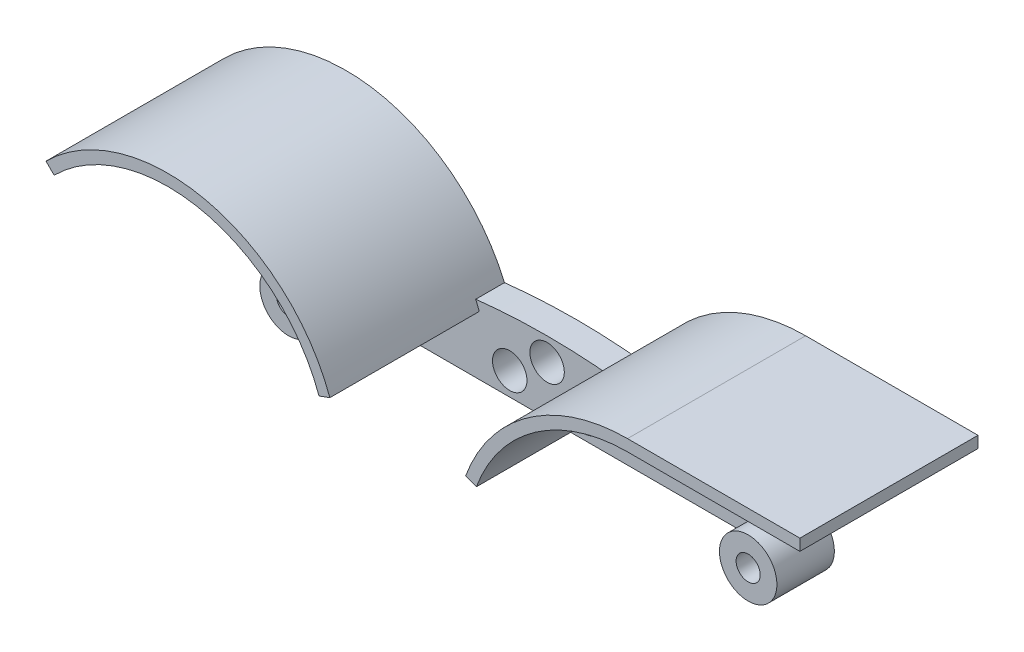
ISO-10303-21;
HEADER;
FILE_DESCRIPTION(('STEP AP214'),'2;1');
FILE_NAME('part.step','',(''),(''),'','','');
FILE_SCHEMA(('AUTOMOTIVE_DESIGN { 1 0 10303 214 1 1 1 1 }'));
ENDSEC;
DATA;
#1=APPLICATION_CONTEXT('core data for automotive mechanical design processes');
#2=APPLICATION_PROTOCOL_DEFINITION('international standard','automotive_design',2000,#1);
#3=PRODUCT_CONTEXT('',#1,'mechanical');
#4=PRODUCT('Part','Part','',(#3));
#5=PRODUCT_RELATED_PRODUCT_CATEGORY('part','',(#4));
#6=PRODUCT_DEFINITION_FORMATION('','',#4);
#7=PRODUCT_DEFINITION_CONTEXT('part definition',#1,'design');
#8=PRODUCT_DEFINITION('design','',#6,#7);
#9=PRODUCT_DEFINITION_SHAPE('','',#8);
#10=(LENGTH_UNIT() NAMED_UNIT(*) SI_UNIT(.MILLI.,.METRE.));
#11=(NAMED_UNIT(*) PLANE_ANGLE_UNIT() SI_UNIT($,.RADIAN.));
#12=(NAMED_UNIT(*) SI_UNIT($,.STERADIAN.) SOLID_ANGLE_UNIT());
#13=UNCERTAINTY_MEASURE_WITH_UNIT(LENGTH_MEASURE(1.E-05),#10,'distance_accuracy_value','');
#14=(GEOMETRIC_REPRESENTATION_CONTEXT(3) GLOBAL_UNCERTAINTY_ASSIGNED_CONTEXT((#13)) GLOBAL_UNIT_ASSIGNED_CONTEXT((#10,
#11,#12)) REPRESENTATION_CONTEXT('',''));
#15=CARTESIAN_POINT('',(0.,0.,0.));
#16=DIRECTION('',(0.,0.,1.));
#17=DIRECTION('',(1.,0.,0.));
#18=AXIS2_PLACEMENT_3D('',#15,#16,#17);
#19=CARTESIAN_POINT('',(0.,-110.416666666667,5.));
#20=DIRECTION('',(0.,0.,-1.));
#21=DIRECTION('',(-1.,0.,0.));
#22=AXIS2_PLACEMENT_3D('',#19,#20,#21);
#23=CYLINDRICAL_SURFACE('',#22,110.416666666667);
#24=CARTESIAN_POINT('',(0.,-110.416666666667,5.));
#25=DIRECTION('',(0.,0.,1.));
#26=DIRECTION('',(-1.,0.,0.));
#27=AXIS2_PLACEMENT_3D('',#24,#25,#26);
#28=CIRCLE('',#27,110.416666666667);
#29=CARTESIAN_POINT('',(12.4179054051825,-0.700506037861745,5.));
#30=VERTEX_POINT('',#29);
#31=CARTESIAN_POINT('',(-12.4179054051825,-0.700506037861745,5.));
#32=VERTEX_POINT('',#31);
#33=EDGE_CURVE('E327',#30,#32,#28,.T.);
#34=ORIENTED_EDGE('',*,*,#33,.F.);
#35=DIRECTION('',(0.,0.,-1.));
#36=VECTOR('',#35,1.);
#37=CARTESIAN_POINT('',(12.4179054051824,-0.700506037861745,2.));
#38=LINE('',#37,#36);
#39=CARTESIAN_POINT('',(12.4179054051824,-0.700506037861745,0.));
#40=VERTEX_POINT('',#39);
#41=EDGE_CURVE('E271',#30,#40,#38,.T.);
#42=ORIENTED_EDGE('',*,*,#41,.T.);
#43=CARTESIAN_POINT('',(0.,-110.416666666667,0.));
#44=DIRECTION('',(0.,0.,1.));
#45=DIRECTION('',(-1.,0.,0.));
#46=AXIS2_PLACEMENT_3D('',#43,#44,#45);
#47=CIRCLE('',#46,110.416666666667);
#48=CARTESIAN_POINT('',(-12.4179054051824,-0.700506037861745,0.));
#49=VERTEX_POINT('',#48);
#50=EDGE_CURVE('E320',#40,#49,#47,.T.);
#51=ORIENTED_EDGE('',*,*,#50,.T.);
#52=DIRECTION('',(0.,0.,-1.));
#53=VECTOR('',#52,1.);
#54=CARTESIAN_POINT('',(-12.4179054051824,-0.700506037861745,2.));
#55=LINE('',#54,#53);
#56=EDGE_CURVE('E249',#32,#49,#55,.T.);
#57=ORIENTED_EDGE('',*,*,#56,.F.);
#58=EDGE_LOOP('',(#34,#42,#51,#57));
#59=FACE_BOUND('',#58,.T.);
#60=ADVANCED_FACE('F35',(#59),#23,.T.);
#61=DIRECTION('',(0.,0.,-1.));
#62=VECTOR('',#61,1.);
#63=CARTESIAN_POINT('',(14.4909177045568,-0.955013189946598,16.5));
#64=LINE('',#63,#62);
#65=CARTESIAN_POINT('',(14.4909177045568,-0.955013189946591,5.));
#66=VERTEX_POINT('',#65);
#67=CARTESIAN_POINT('',(14.4909177045568,-0.955013189946598,2.));
#68=VERTEX_POINT('',#67);
#69=EDGE_CURVE('E203',#66,#68,#64,.T.);
#70=ORIENTED_EDGE('',*,*,#69,.F.);
#71=CARTESIAN_POINT('',(40.,-7.50000000000001,5.));
#72=VERTEX_POINT('',#71);
#73=EDGE_CURVE('E323',#72,#66,#28,.T.);
#74=ORIENTED_EDGE('',*,*,#73,.F.);
#75=DIRECTION('',(0.,0.,-1.));
#76=VECTOR('',#75,1.);
#77=CARTESIAN_POINT('',(40.,-7.5,5.));
#78=LINE('',#77,#76);
#79=CARTESIAN_POINT('',(40.,-7.5,2.));
#80=VERTEX_POINT('',#79);
#81=EDGE_CURVE('E415',#72,#80,#78,.T.);
#82=ORIENTED_EDGE('',*,*,#81,.T.);
#83=CARTESIAN_POINT('',(0.,-110.416666666667,2.));
#84=DIRECTION('',(0.,0.,-1.));
#85=DIRECTION('',(-1.,0.,0.));
#86=AXIS2_PLACEMENT_3D('',#83,#84,#85);
#87=CIRCLE('',#86,110.416666666667);
#88=EDGE_CURVE('E262',#68,#80,#87,.T.);
#89=ORIENTED_EDGE('',*,*,#88,.F.);
#90=EDGE_LOOP('',(#70,#74,#82,#89));
#91=FACE_BOUND('',#90,.T.);
#92=ADVANCED_FACE('F460',(#91),#23,.T.);
#93=CARTESIAN_POINT('',(-40.,-12.5,5.));
#94=DIRECTION('',(0.,0.,1.));
#95=DIRECTION('',(1.,0.,0.));
#96=AXIS2_PLACEMENT_3D('',#93,#94,#95);
#97=PLANE('',#96);
#98=CARTESIAN_POINT('',(6.49999999999999,-8.5,5.));
#99=DIRECTION('',(0.,0.,1.));
#100=DIRECTION('',(1.,0.,0.));
#101=AXIS2_PLACEMENT_3D('',#98,#99,#100);
#102=CIRCLE('',#101,3.);
#103=CARTESIAN_POINT('',(9.49999999999999,-8.5,5.));
#104=VERTEX_POINT('',#103);
#105=EDGE_CURVE('E345',#104,#104,#102,.T.);
#106=ORIENTED_EDGE('',*,*,#105,.F.);
#107=EDGE_LOOP('',(#106));
#108=FACE_BOUND('',#107,.T.);
#109=CARTESIAN_POINT('',(-6.5,-8.5,5.));
#110=DIRECTION('',(0.,0.,1.));
#111=DIRECTION('',(1.,0.,0.));
#112=AXIS2_PLACEMENT_3D('',#109,#110,#111);
#113=CIRCLE('',#112,3.);
#114=CARTESIAN_POINT('',(-3.5,-8.5,5.));
#115=VERTEX_POINT('',#114);
#116=EDGE_CURVE('E342',#115,#115,#113,.T.);
#117=ORIENTED_EDGE('',*,*,#116,.F.);
#118=EDGE_LOOP('',(#117));
#119=FACE_BOUND('',#118,.T.);
#120=CARTESIAN_POINT('',(0.,-4.,5.));
#121=DIRECTION('',(0.,0.,1.));
#122=DIRECTION('',(1.,0.,0.));
#123=AXIS2_PLACEMENT_3D('',#120,#121,#122);
#124=CIRCLE('',#123,3.);
#125=CARTESIAN_POINT('',(3.,-4.,5.));
#126=VERTEX_POINT('',#125);
#127=EDGE_CURVE('E341',#126,#126,#124,.T.);
#128=ORIENTED_EDGE('',*,*,#127,.F.);
#129=EDGE_LOOP('',(#128));
#130=FACE_BOUND('',#129,.T.);
#131=DIRECTION('',(-0.939692620785911,0.342020143325662,0.));
#132=VECTOR('',#131,1.);
#133=CARTESIAN_POINT('',(-30.6417777247595,13.2115043874612,5.));
#134=LINE('',#133,#132);
#135=CARTESIAN_POINT('',(13.6886066179945,-2.92343598688144,5.00000000000001));
#136=VERTEX_POINT('',#135);
#137=CARTESIAN_POINT('',(11.8092213764227,-2.23939570023012,5.00000000000001));
#138=VERTEX_POINT('',#137);
#139=EDGE_CURVE('E11',#136,#138,#134,.T.);
#140=ORIENTED_EDGE('',*,*,#139,.T.);
#141=CARTESIAN_POINT('',(40.,-12.5,5.));
#142=DIRECTION('',(0.,0.,1.));
#143=DIRECTION('',(1.,0.,0.));
#144=AXIS2_PLACEMENT_3D('',#141,#142,#143);
#145=CIRCLE('',#144,30.);
#146=EDGE_CURVE('E199',#138,#30,#145,.F.);
#147=ORIENTED_EDGE('',*,*,#146,.T.);
#148=ORIENTED_EDGE('',*,*,#33,.T.);
#149=CARTESIAN_POINT('',(-40.,-12.5,5.));
#150=DIRECTION('',(0.,0.,1.));
#151=DIRECTION('',(1.,0.,0.));
#152=AXIS2_PLACEMENT_3D('',#149,#150,#151);
#153=CIRCLE('',#152,30.);
#154=CARTESIAN_POINT('',(-11.8092213764228,-2.23939570022993,5.));
#155=VERTEX_POINT('',#154);
#156=EDGE_CURVE('E57',#32,#155,#153,.F.);
#157=ORIENTED_EDGE('',*,*,#156,.T.);
#158=DIRECTION('',(-0.939692620785908,-0.342020143325669,0.));
#159=VECTOR('',#158,1.);
#160=CARTESIAN_POINT('',(-40.,-12.5,5.));
#161=LINE('',#160,#159);
#162=CARTESIAN_POINT('',(-13.6886066179946,-2.92343598688126,5.));
#163=VERTEX_POINT('',#162);
#164=EDGE_CURVE('E52',#155,#163,#161,.T.);
#165=ORIENTED_EDGE('',*,*,#164,.T.);
#166=CARTESIAN_POINT('',(-40.,-12.5,5.));
#167=DIRECTION('',(0.,0.,1.));
#168=DIRECTION('',(1.,0.,0.));
#169=AXIS2_PLACEMENT_3D('',#166,#167,#168);
#170=CIRCLE('',#169,28.);
#171=CARTESIAN_POINT('',(-14.4909177045568,-0.955013189946591,5.));
#172=VERTEX_POINT('',#171);
#173=EDGE_CURVE('E234',#163,#172,#170,.T.);
#174=ORIENTED_EDGE('',*,*,#173,.T.);
#175=CARTESIAN_POINT('',(-40.,-7.50000000000001,5.));
#176=VERTEX_POINT('',#175);
#177=EDGE_CURVE('E319',#172,#176,#28,.T.);
#178=ORIENTED_EDGE('',*,*,#177,.T.);
#179=CARTESIAN_POINT('',(-40.,-12.5,5.));
#180=DIRECTION('',(0.,0.,1.));
#181=DIRECTION('',(1.,0.,0.));
#182=AXIS2_PLACEMENT_3D('',#179,#180,#181);
#183=CIRCLE('',#182,5.);
#184=CARTESIAN_POINT('',(-35.,-12.5,5.));
#185=VERTEX_POINT('',#184);
#186=EDGE_CURVE('E296',#185,#176,#183,.T.);
#187=ORIENTED_EDGE('',*,*,#186,.F.);
#188=DIRECTION('',(1.,0.,0.));
#189=VECTOR('',#188,1.);
#190=CARTESIAN_POINT('',(-35.,-12.5,5.));
#191=LINE('',#190,#189);
#192=CARTESIAN_POINT('',(35.,-12.5,5.));
#193=VERTEX_POINT('',#192);
#194=EDGE_CURVE('E317',#185,#193,#191,.T.);
#195=ORIENTED_EDGE('',*,*,#194,.T.);
#196=CARTESIAN_POINT('',(40.,-12.5,5.));
#197=DIRECTION('',(0.,0.,1.));
#198=DIRECTION('',(1.,0.,0.));
#199=AXIS2_PLACEMENT_3D('',#196,#197,#198);
#200=CIRCLE('',#199,5.);
#201=EDGE_CURVE('E285',#72,#193,#200,.T.);
#202=ORIENTED_EDGE('',*,*,#201,.F.);
#203=ORIENTED_EDGE('',*,*,#73,.T.);
#204=CARTESIAN_POINT('',(40.,-12.5,5.));
#205=DIRECTION('',(0.,0.,1.));
#206=DIRECTION('',(1.,0.,0.));
#207=AXIS2_PLACEMENT_3D('',#204,#205,#206);
#208=CIRCLE('',#207,28.);
#209=EDGE_CURVE('E200',#66,#136,#208,.T.);
#210=ORIENTED_EDGE('',*,*,#209,.T.);
#211=EDGE_LOOP('',(#140,#147,#148,#157,#165,#174,#178,#187,#195,#202,#203,#210));
#212=FACE_BOUND('',#211,.T.);
#213=ADVANCED_FACE('F446',(#108,#119,#130,#212),#97,.T.);
#214=CARTESIAN_POINT('',(0.,0.,2.));
#215=DIRECTION('',(0.,0.,-1.));
#216=DIRECTION('',(-1.,0.,0.));
#217=AXIS2_PLACEMENT_3D('',#214,#215,#216);
#218=PLANE('',#217);
#219=CARTESIAN_POINT('',(40.,-12.5,2.));
#220=DIRECTION('',(0.,0.,-1.));
#221=DIRECTION('',(-1.,0.,0.));
#222=AXIS2_PLACEMENT_3D('',#219,#220,#221);
#223=CIRCLE('',#222,28.);
#224=CARTESIAN_POINT('',(40.,15.5,2.));
#225=VERTEX_POINT('',#224);
#226=EDGE_CURVE('E44',#68,#225,#223,.T.);
#227=ORIENTED_EDGE('',*,*,#226,.F.);
#228=ORIENTED_EDGE('',*,*,#88,.T.);
#229=CARTESIAN_POINT('',(40.,-12.5,2.));
#230=DIRECTION('',(0.,0.,-1.));
#231=DIRECTION('',(-1.,0.,0.));
#232=AXIS2_PLACEMENT_3D('',#229,#230,#231);
#233=CIRCLE('',#232,5.);
#234=CARTESIAN_POINT('',(43.6552763412143,-9.08840874819995,2.));
#235=VERTEX_POINT('',#234);
#236=EDGE_CURVE('E268',#80,#235,#233,.T.);
#237=ORIENTED_EDGE('',*,*,#236,.T.);
#238=DIRECTION('',(-0.731055268242869,-0.682318250360011,0.));
#239=VECTOR('',#238,1.);
#240=CARTESIAN_POINT('',(24.8574821852732,-26.6330166270784,2.));
#241=LINE('',#240,#239);
#242=CARTESIAN_POINT('',(70.,15.5,2.));
#243=VERTEX_POINT('',#242);
#244=EDGE_CURVE('E264',#243,#235,#241,.T.);
#245=ORIENTED_EDGE('',*,*,#244,.F.);
#246=DIRECTION('',(1.,0.,0.));
#247=VECTOR('',#246,1.);
#248=CARTESIAN_POINT('',(70.,15.5,2.));
#249=LINE('',#248,#247);
#250=EDGE_CURVE('E194',#225,#243,#249,.T.);
#251=ORIENTED_EDGE('',*,*,#250,.F.);
#252=EDGE_LOOP('',(#227,#228,#237,#245,#251));
#253=FACE_BOUND('',#252,.T.);
#254=ADVANCED_FACE('F390',(#253),#218,.F.);
#255=DIRECTION('',(0.,0.,-1.));
#256=VECTOR('',#255,1.);
#257=CARTESIAN_POINT('',(-14.4909177045568,-0.955013189946601,16.5));
#258=LINE('',#257,#256);
#259=CARTESIAN_POINT('',(-14.4909177045568,-0.955013189946591,2.));
#260=VERTEX_POINT('',#259);
#261=EDGE_CURVE('E236',#260,#172,#258,.F.);
#262=ORIENTED_EDGE('',*,*,#261,.F.);
#263=CARTESIAN_POINT('',(0.,-110.416666666667,2.));
#264=DIRECTION('',(0.,0.,-1.));
#265=DIRECTION('',(-1.,0.,0.));
#266=AXIS2_PLACEMENT_3D('',#263,#264,#265);
#267=CIRCLE('',#266,110.416666666667);
#268=CARTESIAN_POINT('',(-40.,-7.50000000000001,2.));
#269=VERTEX_POINT('',#268);
#270=EDGE_CURVE('E240',#269,#260,#267,.T.);
#271=ORIENTED_EDGE('',*,*,#270,.F.);
#272=DIRECTION('',(0.,0.,-1.));
#273=VECTOR('',#272,1.);
#274=CARTESIAN_POINT('',(-40.,-7.50000000000001,5.));
#275=LINE('',#274,#273);
#276=EDGE_CURVE('E326',#176,#269,#275,.T.);
#277=ORIENTED_EDGE('',*,*,#276,.F.);
#278=ORIENTED_EDGE('',*,*,#177,.F.);
#279=EDGE_LOOP('',(#262,#271,#277,#278));
#280=FACE_BOUND('',#279,.T.);
#281=ADVANCED_FACE('F447',(#280),#23,.T.);
#282=CARTESIAN_POINT('',(0.,0.,2.));
#283=DIRECTION('',(0.,0.,-1.));
#284=DIRECTION('',(-1.,0.,0.));
#285=AXIS2_PLACEMENT_3D('',#282,#283,#284);
#286=PLANE('',#285);
#287=CARTESIAN_POINT('',(-40.,-12.5,2.));
#288=DIRECTION('',(0.,0.,-1.));
#289=DIRECTION('',(-1.,0.,0.));
#290=AXIS2_PLACEMENT_3D('',#287,#288,#289);
#291=CIRCLE('',#290,28.);
#292=CARTESIAN_POINT('',(-59.7989898732234,7.29898987322321,2.));
#293=VERTEX_POINT('',#292);
#294=EDGE_CURVE('E211',#293,#260,#291,.T.);
#295=ORIENTED_EDGE('',*,*,#294,.F.);
#296=DIRECTION('',(0.707106781186551,-0.707106781186544,0.));
#297=VECTOR('',#296,1.);
#298=CARTESIAN_POINT('',(-26.2499999999998,-26.2500000000001,2.));
#299=LINE('',#298,#297);
#300=CARTESIAN_POINT('',(-43.5355339059328,-8.96446609406728,2.));
#301=VERTEX_POINT('',#300);
#302=EDGE_CURVE('E247',#293,#301,#299,.T.);
#303=ORIENTED_EDGE('',*,*,#302,.T.);
#304=CARTESIAN_POINT('',(-40.,-12.5,2.));
#305=DIRECTION('',(0.,0.,-1.));
#306=DIRECTION('',(-1.,0.,0.));
#307=AXIS2_PLACEMENT_3D('',#304,#305,#306);
#308=CIRCLE('',#307,5.);
#309=EDGE_CURVE('E243',#301,#269,#308,.T.);
#310=ORIENTED_EDGE('',*,*,#309,.T.);
#311=ORIENTED_EDGE('',*,*,#270,.T.);
#312=EDGE_LOOP('',(#295,#303,#310,#311));
#313=FACE_BOUND('',#312,.T.);
#314=ADVANCED_FACE('F430',(#313),#286,.F.);
#315=CARTESIAN_POINT('',(-40.,-12.5,5.));
#316=DIRECTION('',(0.,0.,-1.));
#317=DIRECTION('',(-1.,0.,0.));
#318=AXIS2_PLACEMENT_3D('',#315,#316,#317);
#319=CYLINDRICAL_SURFACE('',#318,5.);
#320=CARTESIAN_POINT('',(-40.,-12.5,10.));
#321=DIRECTION('',(0.,0.,1.));
#322=DIRECTION('',(1.,0.,0.));
#323=AXIS2_PLACEMENT_3D('',#320,#321,#322);
#324=CIRCLE('',#323,5.);
#325=CARTESIAN_POINT('',(-35.,-12.5,10.));
#326=VERTEX_POINT('',#325);
#327=EDGE_CURVE('E299',#326,#326,#324,.T.);
#328=ORIENTED_EDGE('',*,*,#327,.F.);
#329=EDGE_LOOP('',(#328));
#330=FACE_BOUND('',#329,.T.);
#331=DIRECTION('',(0.,0.,-1.));
#332=VECTOR('',#331,1.);
#333=CARTESIAN_POINT('',(-43.5355339059328,-8.96446609406728,2.));
#334=LINE('',#333,#332);
#335=CARTESIAN_POINT('',(-43.5355339059328,-8.96446609406728,0.));
#336=VERTEX_POINT('',#335);
#337=EDGE_CURVE('E258',#301,#336,#334,.T.);
#338=ORIENTED_EDGE('',*,*,#337,.T.);
#339=CARTESIAN_POINT('',(-40.,-12.5,0.));
#340=DIRECTION('',(0.,0.,1.));
#341=DIRECTION('',(1.,0.,0.));
#342=AXIS2_PLACEMENT_3D('',#339,#340,#341);
#343=CIRCLE('',#342,5.);
#344=CARTESIAN_POINT('',(-35.,-12.5,0.));
#345=VERTEX_POINT('',#344);
#346=EDGE_CURVE('E302',#336,#345,#343,.T.);
#347=ORIENTED_EDGE('',*,*,#346,.T.);
#348=DIRECTION('',(0.,0.,-1.));
#349=VECTOR('',#348,1.);
#350=CARTESIAN_POINT('',(-35.,-12.5,5.));
#351=LINE('',#350,#349);
#352=EDGE_CURVE('E312',#185,#345,#351,.T.);
#353=ORIENTED_EDGE('',*,*,#352,.F.);
#354=ORIENTED_EDGE('',*,*,#186,.T.);
#355=ORIENTED_EDGE('',*,*,#276,.T.);
#356=ORIENTED_EDGE('',*,*,#309,.F.);
#357=EDGE_LOOP('',(#338,#347,#353,#354,#355,#356));
#358=FACE_BOUND('',#357,.T.);
#359=ADVANCED_FACE('F37',(#330,#358),#319,.T.);
#360=CARTESIAN_POINT('',(-35.,-12.5,5.));
#361=DIRECTION('',(0.,1.,0.));
#362=DIRECTION('',(0.,0.,1.));
#363=AXIS2_PLACEMENT_3D('',#360,#361,#362);
#364=PLANE('',#363);
#365=DIRECTION('',(1.,0.,0.));
#366=VECTOR('',#365,1.);
#367=CARTESIAN_POINT('',(-35.,-12.5,0.));
#368=LINE('',#367,#366);
#369=CARTESIAN_POINT('',(35.,-12.5,0.));
#370=VERTEX_POINT('',#369);
#371=EDGE_CURVE('E413',#345,#370,#368,.T.);
#372=ORIENTED_EDGE('',*,*,#371,.T.);
#373=DIRECTION('',(0.,0.,-1.));
#374=VECTOR('',#373,1.);
#375=CARTESIAN_POINT('',(35.,-12.5,5.));
#376=LINE('',#375,#374);
#377=EDGE_CURVE('E310',#193,#370,#376,.T.);
#378=ORIENTED_EDGE('',*,*,#377,.F.);
#379=ORIENTED_EDGE('',*,*,#194,.F.);
#380=ORIENTED_EDGE('',*,*,#352,.T.);
#381=EDGE_LOOP('',(#372,#378,#379,#380));
#382=FACE_BOUND('',#381,.T.);
#383=ADVANCED_FACE('F440',(#382),#364,.F.);
#384=CARTESIAN_POINT('',(40.,-12.5,5.));
#385=DIRECTION('',(0.,0.,-1.));
#386=DIRECTION('',(-1.,0.,0.));
#387=AXIS2_PLACEMENT_3D('',#384,#385,#386);
#388=CYLINDRICAL_SURFACE('',#387,5.);
#389=CARTESIAN_POINT('',(40.,-12.5,0.));
#390=DIRECTION('',(0.,0.,1.));
#391=DIRECTION('',(1.,0.,0.));
#392=AXIS2_PLACEMENT_3D('',#389,#390,#391);
#393=CIRCLE('',#392,5.);
#394=CARTESIAN_POINT('',(43.6552763412143,-9.08840874819995,0.));
#395=VERTEX_POINT('',#394);
#396=EDGE_CURVE('E411',#370,#395,#393,.T.);
#397=ORIENTED_EDGE('',*,*,#396,.T.);
#398=DIRECTION('',(0.,0.,-1.));
#399=VECTOR('',#398,1.);
#400=CARTESIAN_POINT('',(43.6552763412143,-9.08840874819995,2.));
#401=LINE('',#400,#399);
#402=EDGE_CURVE('E282',#235,#395,#401,.T.);
#403=ORIENTED_EDGE('',*,*,#402,.F.);
#404=ORIENTED_EDGE('',*,*,#236,.F.);
#405=ORIENTED_EDGE('',*,*,#81,.F.);
#406=ORIENTED_EDGE('',*,*,#201,.T.);
#407=ORIENTED_EDGE('',*,*,#377,.T.);
#408=EDGE_LOOP('',(#397,#403,#404,#405,#406,#407));
#409=FACE_BOUND('',#408,.T.);
#410=CARTESIAN_POINT('',(40.,-12.5,10.));
#411=DIRECTION('',(0.,0.,1.));
#412=DIRECTION('',(1.,0.,0.));
#413=AXIS2_PLACEMENT_3D('',#410,#411,#412);
#414=CIRCLE('',#413,5.);
#415=CARTESIAN_POINT('',(45.,-12.5,10.));
#416=VERTEX_POINT('',#415);
#417=EDGE_CURVE('E293',#416,#416,#414,.T.);
#418=ORIENTED_EDGE('',*,*,#417,.F.);
#419=EDGE_LOOP('',(#418));
#420=FACE_BOUND('',#419,.T.);
#421=ADVANCED_FACE('F443',(#409,#420),#388,.T.);
#422=CARTESIAN_POINT('',(-40.,-12.5,0.));
#423=DIRECTION('',(0.,0.,1.));
#424=DIRECTION('',(1.,0.,0.));
#425=AXIS2_PLACEMENT_3D('',#422,#423,#424);
#426=PLANE('',#425);
#427=CARTESIAN_POINT('',(6.49999999999999,-8.5,0.));
#428=DIRECTION('',(0.,0.,1.));
#429=DIRECTION('',(1.,0.,0.));
#430=AXIS2_PLACEMENT_3D('',#427,#428,#429);
#431=CIRCLE('',#430,3.);
#432=CARTESIAN_POINT('',(9.49999999999999,-8.5,0.));
#433=VERTEX_POINT('',#432);
#434=EDGE_CURVE('E39',#433,#433,#431,.T.);
#435=ORIENTED_EDGE('',*,*,#434,.T.);
#436=EDGE_LOOP('',(#435));
#437=FACE_BOUND('',#436,.T.);
#438=CARTESIAN_POINT('',(-6.5,-8.5,0.));
#439=DIRECTION('',(0.,0.,1.));
#440=DIRECTION('',(1.,0.,0.));
#441=AXIS2_PLACEMENT_3D('',#438,#439,#440);
#442=CIRCLE('',#441,3.);
#443=CARTESIAN_POINT('',(-3.5,-8.5,0.));
#444=VERTEX_POINT('',#443);
#445=EDGE_CURVE('E343',#444,#444,#442,.T.);
#446=ORIENTED_EDGE('',*,*,#445,.T.);
#447=EDGE_LOOP('',(#446));
#448=FACE_BOUND('',#447,.T.);
#449=CARTESIAN_POINT('',(0.,-4.,0.));
#450=DIRECTION('',(0.,0.,1.));
#451=DIRECTION('',(1.,0.,0.));
#452=AXIS2_PLACEMENT_3D('',#449,#450,#451);
#453=CIRCLE('',#452,3.);
#454=CARTESIAN_POINT('',(3.,-4.,0.));
#455=VERTEX_POINT('',#454);
#456=EDGE_CURVE('E339',#455,#455,#453,.T.);
#457=ORIENTED_EDGE('',*,*,#456,.T.);
#458=EDGE_LOOP('',(#457));
#459=FACE_BOUND('',#458,.T.);
#460=CARTESIAN_POINT('',(40.,-12.5,0.));
#461=DIRECTION('',(0.,0.,1.));
#462=DIRECTION('',(1.,0.,0.));
#463=AXIS2_PLACEMENT_3D('',#460,#461,#462);
#464=CIRCLE('',#463,2.1);
#465=CARTESIAN_POINT('',(42.1,-12.5,0.));
#466=VERTEX_POINT('',#465);
#467=EDGE_CURVE('E361',#466,#466,#464,.T.);
#468=ORIENTED_EDGE('',*,*,#467,.T.);
#469=EDGE_LOOP('',(#468));
#470=FACE_BOUND('',#469,.T.);
#471=CARTESIAN_POINT('',(-40.,-12.5,0.));
#472=DIRECTION('',(0.,0.,1.));
#473=DIRECTION('',(1.,0.,0.));
#474=AXIS2_PLACEMENT_3D('',#471,#472,#473);
#475=CIRCLE('',#474,2.1);
#476=CARTESIAN_POINT('',(-37.9,-12.5,0.));
#477=VERTEX_POINT('',#476);
#478=EDGE_CURVE('E367',#477,#477,#475,.T.);
#479=ORIENTED_EDGE('',*,*,#478,.T.);
#480=EDGE_LOOP('',(#479));
#481=FACE_BOUND('',#480,.T.);
#482=ORIENTED_EDGE('',*,*,#346,.F.);
#483=DIRECTION('',(0.707106781186551,-0.707106781186544,0.));
#484=VECTOR('',#483,1.);
#485=CARTESIAN_POINT('',(-26.2499999999998,-26.2500000000001,0.));
#486=LINE('',#485,#484);
#487=CARTESIAN_POINT('',(-61.2132034355965,8.71320343559631,0.));
#488=VERTEX_POINT('',#487);
#489=EDGE_CURVE('E244',#488,#336,#486,.T.);
#490=ORIENTED_EDGE('',*,*,#489,.F.);
#491=CARTESIAN_POINT('',(-40.,-12.5,0.));
#492=DIRECTION('',(0.,0.,-1.));
#493=DIRECTION('',(-1.,0.,0.));
#494=AXIS2_PLACEMENT_3D('',#491,#492,#493);
#495=CIRCLE('',#494,30.);
#496=EDGE_CURVE('E239',#49,#488,#495,.F.);
#497=ORIENTED_EDGE('',*,*,#496,.F.);
#498=ORIENTED_EDGE('',*,*,#50,.F.);
#499=CARTESIAN_POINT('',(40.,-12.5,0.));
#500=DIRECTION('',(0.,0.,-1.));
#501=DIRECTION('',(-1.,0.,0.));
#502=AXIS2_PLACEMENT_3D('',#499,#500,#501);
#503=CIRCLE('',#502,30.);
#504=CARTESIAN_POINT('',(40.,17.5,0.));
#505=VERTEX_POINT('',#504);
#506=EDGE_CURVE('E257',#40,#505,#503,.T.);
#507=ORIENTED_EDGE('',*,*,#506,.T.);
#508=DIRECTION('',(1.,0.,0.));
#509=VECTOR('',#508,1.);
#510=CARTESIAN_POINT('',(0.,17.5,0.));
#511=LINE('',#510,#509);
#512=CARTESIAN_POINT('',(70.,17.5,0.));
#513=VERTEX_POINT('',#512);
#514=EDGE_CURVE('E274',#505,#513,#511,.T.);
#515=ORIENTED_EDGE('',*,*,#514,.T.);
#516=DIRECTION('',(0.,-1.,0.));
#517=VECTOR('',#516,1.);
#518=CARTESIAN_POINT('',(70.,0.,0.));
#519=LINE('',#518,#517);
#520=CARTESIAN_POINT('',(70.,15.5,0.));
#521=VERTEX_POINT('',#520);
#522=EDGE_CURVE('E277',#513,#521,#519,.T.);
#523=ORIENTED_EDGE('',*,*,#522,.T.);
#524=DIRECTION('',(-0.731055268242869,-0.682318250360011,0.));
#525=VECTOR('',#524,1.);
#526=CARTESIAN_POINT('',(24.8574821852732,-26.6330166270784,0.));
#527=LINE('',#526,#525);
#528=EDGE_CURVE('E265',#521,#395,#527,.T.);
#529=ORIENTED_EDGE('',*,*,#528,.T.);
#530=ORIENTED_EDGE('',*,*,#396,.F.);
#531=ORIENTED_EDGE('',*,*,#371,.F.);
#532=EDGE_LOOP('',(#482,#490,#497,#498,#507,#515,#523,#529,#530,#531));
#533=FACE_BOUND('',#532,.T.);
#534=ADVANCED_FACE('F407',(#437,#448,#459,#470,#481,#533),#426,.F.);
#535=CARTESIAN_POINT('',(-40.,-12.5,10.));
#536=DIRECTION('',(0.,0.,1.));
#537=DIRECTION('',(1.,0.,0.));
#538=AXIS2_PLACEMENT_3D('',#535,#536,#537);
#539=PLANE('',#538);
#540=CARTESIAN_POINT('',(-40.,-12.5,10.));
#541=DIRECTION('',(0.,0.,1.));
#542=DIRECTION('',(1.,0.,0.));
#543=AXIS2_PLACEMENT_3D('',#540,#541,#542);
#544=CIRCLE('',#543,2.1);
#545=CARTESIAN_POINT('',(-37.9,-12.5,10.));
#546=VERTEX_POINT('',#545);
#547=EDGE_CURVE('E364',#546,#546,#544,.T.);
#548=ORIENTED_EDGE('',*,*,#547,.F.);
#549=EDGE_LOOP('',(#548));
#550=FACE_BOUND('',#549,.T.);
#551=ORIENTED_EDGE('',*,*,#327,.T.);
#552=EDGE_LOOP('',(#551));
#553=FACE_BOUND('',#552,.T.);
#554=ADVANCED_FACE('F494',(#550,#553),#539,.T.);
#555=CARTESIAN_POINT('',(40.,-12.5,10.));
#556=DIRECTION('',(0.,0.,1.));
#557=DIRECTION('',(1.,0.,0.));
#558=AXIS2_PLACEMENT_3D('',#555,#556,#557);
#559=PLANE('',#558);
#560=CARTESIAN_POINT('',(40.,-12.5,10.));
#561=DIRECTION('',(0.,0.,1.));
#562=DIRECTION('',(1.,0.,0.));
#563=AXIS2_PLACEMENT_3D('',#560,#561,#562);
#564=CIRCLE('',#563,2.1);
#565=CARTESIAN_POINT('',(42.1,-12.5,10.));
#566=VERTEX_POINT('',#565);
#567=EDGE_CURVE('E358',#566,#566,#564,.T.);
#568=ORIENTED_EDGE('',*,*,#567,.F.);
#569=EDGE_LOOP('',(#568));
#570=FACE_BOUND('',#569,.T.);
#571=ORIENTED_EDGE('',*,*,#417,.T.);
#572=EDGE_LOOP('',(#571));
#573=FACE_BOUND('',#572,.T.);
#574=ADVANCED_FACE('F485',(#570,#573),#559,.T.);
#575=CARTESIAN_POINT('',(24.8574821852732,-26.6330166270784,2.));
#576=DIRECTION('',(0.682318250360011,-0.731055268242869,0.));
#577=DIRECTION('',(0.731055268242869,0.682318250360011,0.));
#578=AXIS2_PLACEMENT_3D('',#575,#576,#577);
#579=PLANE('',#578);
#580=ORIENTED_EDGE('',*,*,#528,.F.);
#581=DIRECTION('',(0.,0.,-1.));
#582=VECTOR('',#581,1.);
#583=CARTESIAN_POINT('',(70.,15.5,2.));
#584=LINE('',#583,#582);
#585=EDGE_CURVE('E286',#243,#521,#584,.T.);
#586=ORIENTED_EDGE('',*,*,#585,.F.);
#587=ORIENTED_EDGE('',*,*,#244,.T.);
#588=ORIENTED_EDGE('',*,*,#402,.T.);
#589=EDGE_LOOP('',(#580,#586,#587,#588));
#590=FACE_BOUND('',#589,.T.);
#591=ADVANCED_FACE('F396',(#590),#579,.T.);
#592=CARTESIAN_POINT('',(70.,0.,2.));
#593=DIRECTION('',(1.,0.,0.));
#594=DIRECTION('',(0.,0.,-1.));
#595=AXIS2_PLACEMENT_3D('',#592,#593,#594);
#596=PLANE('',#595);
#597=ORIENTED_EDGE('',*,*,#522,.F.);
#598=DIRECTION('',(0.,0.,-1.));
#599=VECTOR('',#598,1.);
#600=CARTESIAN_POINT('',(70.,17.5,2.));
#601=LINE('',#600,#599);
#602=CARTESIAN_POINT('',(70.,17.5,31.));
#603=VERTEX_POINT('',#602);
#604=EDGE_CURVE('E288',#603,#513,#601,.T.);
#605=ORIENTED_EDGE('',*,*,#604,.F.);
#606=DIRECTION('',(0.,1.,0.));
#607=VECTOR('',#606,1.);
#608=CARTESIAN_POINT('',(70.,17.5,31.));
#609=LINE('',#608,#607);
#610=CARTESIAN_POINT('',(70.,15.5,31.));
#611=VERTEX_POINT('',#610);
#612=EDGE_CURVE('E373',#611,#603,#609,.T.);
#613=ORIENTED_EDGE('',*,*,#612,.F.);
#614=DIRECTION('',(0.,0.,-1.));
#615=VECTOR('',#614,1.);
#616=CARTESIAN_POINT('',(70.,15.5,31.));
#617=LINE('',#616,#615);
#618=EDGE_CURVE('E376',#611,#243,#617,.T.);
#619=ORIENTED_EDGE('',*,*,#618,.T.);
#620=ORIENTED_EDGE('',*,*,#585,.T.);
#621=EDGE_LOOP('',(#597,#605,#613,#619,#620));
#622=FACE_BOUND('',#621,.T.);
#623=ADVANCED_FACE('F399',(#622),#596,.T.);
#624=CARTESIAN_POINT('',(0.,17.5,2.));
#625=DIRECTION('',(0.,1.,0.));
#626=DIRECTION('',(0.,0.,1.));
#627=AXIS2_PLACEMENT_3D('',#624,#625,#626);
#628=PLANE('',#627);
#629=ORIENTED_EDGE('',*,*,#514,.F.);
#630=DIRECTION('',(0.,0.,-1.));
#631=VECTOR('',#630,1.);
#632=CARTESIAN_POINT('',(40.,17.5,2.));
#633=LINE('',#632,#631);
#634=CARTESIAN_POINT('',(40.,17.5,31.));
#635=VERTEX_POINT('',#634);
#636=EDGE_CURVE('E290',#635,#505,#633,.T.);
#637=ORIENTED_EDGE('',*,*,#636,.F.);
#638=DIRECTION('',(-1.,0.,0.));
#639=VECTOR('',#638,1.);
#640=CARTESIAN_POINT('',(40.,17.5,31.));
#641=LINE('',#640,#639);
#642=EDGE_CURVE('E192',#603,#635,#641,.T.);
#643=ORIENTED_EDGE('',*,*,#642,.F.);
#644=ORIENTED_EDGE('',*,*,#604,.T.);
#645=EDGE_LOOP('',(#629,#637,#643,#644));
#646=FACE_BOUND('',#645,.T.);
#647=ADVANCED_FACE('F403',(#646),#628,.T.);
#648=CARTESIAN_POINT('',(40.,-12.5,2.));
#649=DIRECTION('',(0.,0.,-1.));
#650=DIRECTION('',(-1.,0.,0.));
#651=AXIS2_PLACEMENT_3D('',#648,#649,#650);
#652=CYLINDRICAL_SURFACE('',#651,30.);
#653=ORIENTED_EDGE('',*,*,#506,.F.);
#654=ORIENTED_EDGE('',*,*,#41,.F.);
#655=ORIENTED_EDGE('',*,*,#146,.F.);
#656=DIRECTION('',(0.,0.,-1.));
#657=VECTOR('',#656,1.);
#658=CARTESIAN_POINT('',(11.8092213764227,-2.23939570023012,31.));
#659=LINE('',#658,#657);
#660=CARTESIAN_POINT('',(11.8092213764227,-2.23939570023012,31.));
#661=VERTEX_POINT('',#660);
#662=EDGE_CURVE('E179',#661,#138,#659,.T.);
#663=ORIENTED_EDGE('',*,*,#662,.F.);
#664=CARTESIAN_POINT('',(40.,-12.5,31.));
#665=DIRECTION('',(0.,0.,1.));
#666=DIRECTION('',(-1.,0.,0.));
#667=AXIS2_PLACEMENT_3D('',#664,#665,#666);
#668=CIRCLE('',#667,30.);
#669=EDGE_CURVE('E185',#635,#661,#668,.T.);
#670=ORIENTED_EDGE('',*,*,#669,.F.);
#671=ORIENTED_EDGE('',*,*,#636,.T.);
#672=EDGE_LOOP('',(#653,#654,#655,#663,#670,#671));
#673=FACE_BOUND('',#672,.T.);
#674=ADVANCED_FACE('F197',(#673),#652,.T.);
#675=CARTESIAN_POINT('',(-40.,-12.5,2.));
#676=DIRECTION('',(0.,0.,-1.));
#677=DIRECTION('',(-1.,0.,0.));
#678=AXIS2_PLACEMENT_3D('',#675,#676,#677);
#679=CYLINDRICAL_SURFACE('',#678,30.);
#680=ORIENTED_EDGE('',*,*,#496,.T.);
#681=DIRECTION('',(0.,0.,-1.));
#682=VECTOR('',#681,1.);
#683=CARTESIAN_POINT('',(-61.2132034355965,8.71320343559631,2.));
#684=LINE('',#683,#682);
#685=CARTESIAN_POINT('',(-61.2132034355965,8.71320343559631,31.));
#686=VERTEX_POINT('',#685);
#687=EDGE_CURVE('E254',#686,#488,#684,.T.);
#688=ORIENTED_EDGE('',*,*,#687,.F.);
#689=CARTESIAN_POINT('',(-40.,-12.5,31.));
#690=DIRECTION('',(0.,0.,1.));
#691=DIRECTION('',(-1.,0.,0.));
#692=AXIS2_PLACEMENT_3D('',#689,#690,#691);
#693=CIRCLE('',#692,30.);
#694=CARTESIAN_POINT('',(-11.8092213764228,-2.23939570022993,31.));
#695=VERTEX_POINT('',#694);
#696=EDGE_CURVE('E217',#695,#686,#693,.T.);
#697=ORIENTED_EDGE('',*,*,#696,.F.);
#698=DIRECTION('',(0.,0.,-1.));
#699=VECTOR('',#698,1.);
#700=CARTESIAN_POINT('',(-11.8092213764228,-2.23939570022993,31.));
#701=LINE('',#700,#699);
#702=EDGE_CURVE('E227',#695,#155,#701,.T.);
#703=ORIENTED_EDGE('',*,*,#702,.T.);
#704=ORIENTED_EDGE('',*,*,#156,.F.);
#705=ORIENTED_EDGE('',*,*,#56,.T.);
#706=EDGE_LOOP('',(#680,#688,#697,#703,#704,#705));
#707=FACE_BOUND('',#706,.T.);
#708=ADVANCED_FACE('F456',(#707),#679,.T.);
#709=CARTESIAN_POINT('',(-26.2499999999998,-26.2500000000001,2.));
#710=DIRECTION('',(0.707106781186544,0.707106781186551,0.));
#711=DIRECTION('',(-0.707106781186551,0.707106781186544,0.));
#712=AXIS2_PLACEMENT_3D('',#709,#710,#711);
#713=PLANE('',#712);
#714=ORIENTED_EDGE('',*,*,#489,.T.);
#715=ORIENTED_EDGE('',*,*,#337,.F.);
#716=ORIENTED_EDGE('',*,*,#302,.F.);
#717=DIRECTION('',(0.,0.,-1.));
#718=VECTOR('',#717,1.);
#719=CARTESIAN_POINT('',(-59.7989898732234,7.29898987322321,31.));
#720=LINE('',#719,#718);
#721=CARTESIAN_POINT('',(-59.7989898732234,7.29898987322321,31.));
#722=VERTEX_POINT('',#721);
#723=EDGE_CURVE('E222',#722,#293,#720,.T.);
#724=ORIENTED_EDGE('',*,*,#723,.F.);
#725=DIRECTION('',(0.707106781186545,-0.70710678118655,0.));
#726=VECTOR('',#725,1.);
#727=CARTESIAN_POINT('',(-59.7989898732234,7.29898987322321,31.));
#728=LINE('',#727,#726);
#729=EDGE_CURVE('E220',#686,#722,#728,.T.);
#730=ORIENTED_EDGE('',*,*,#729,.F.);
#731=ORIENTED_EDGE('',*,*,#687,.T.);
#732=EDGE_LOOP('',(#714,#715,#716,#724,#730,#731));
#733=FACE_BOUND('',#732,.T.);
#734=ADVANCED_FACE('F433',(#733),#713,.F.);
#735=CARTESIAN_POINT('',(-40.,-12.5,31.));
#736=DIRECTION('',(0.,0.,-1.));
#737=DIRECTION('',(-1.,0.,0.));
#738=AXIS2_PLACEMENT_3D('',#735,#736,#737);
#739=CYLINDRICAL_SURFACE('',#738,28.);
#740=ORIENTED_EDGE('',*,*,#294,.T.);
#741=ORIENTED_EDGE('',*,*,#261,.T.);
#742=ORIENTED_EDGE('',*,*,#173,.F.);
#743=DIRECTION('',(0.,0.,-1.));
#744=VECTOR('',#743,1.);
#745=CARTESIAN_POINT('',(-13.6886066179946,-2.92343598688126,31.));
#746=LINE('',#745,#744);
#747=CARTESIAN_POINT('',(-13.6886066179946,-2.92343598688126,31.));
#748=VERTEX_POINT('',#747);
#749=EDGE_CURVE('E230',#748,#163,#746,.T.);
#750=ORIENTED_EDGE('',*,*,#749,.F.);
#751=CARTESIAN_POINT('',(-40.,-12.5,31.));
#752=DIRECTION('',(0.,0.,-1.));
#753=DIRECTION('',(-1.,0.,0.));
#754=AXIS2_PLACEMENT_3D('',#751,#752,#753);
#755=CIRCLE('',#754,28.);
#756=EDGE_CURVE('E212',#722,#748,#755,.T.);
#757=ORIENTED_EDGE('',*,*,#756,.F.);
#758=ORIENTED_EDGE('',*,*,#723,.T.);
#759=EDGE_LOOP('',(#740,#741,#742,#750,#757,#758));
#760=FACE_BOUND('',#759,.T.);
#761=ADVANCED_FACE('F449',(#760),#739,.F.);
#762=CARTESIAN_POINT('',(-11.8092213764228,-2.23939570022992,31.));
#763=DIRECTION('',(-0.342020143325669,0.939692620785908,0.));
#764=DIRECTION('',(-0.939692620785908,-0.342020143325669,0.));
#765=AXIS2_PLACEMENT_3D('',#762,#763,#764);
#766=PLANE('',#765);
#767=ORIENTED_EDGE('',*,*,#164,.F.);
#768=ORIENTED_EDGE('',*,*,#702,.F.);
#769=DIRECTION('',(0.939692620785908,0.342020143325669,0.));
#770=VECTOR('',#769,1.);
#771=CARTESIAN_POINT('',(-11.8092213764228,-2.23939570022992,31.));
#772=LINE('',#771,#770);
#773=EDGE_CURVE('E215',#748,#695,#772,.T.);
#774=ORIENTED_EDGE('',*,*,#773,.F.);
#775=ORIENTED_EDGE('',*,*,#749,.T.);
#776=EDGE_LOOP('',(#767,#768,#774,#775));
#777=FACE_BOUND('',#776,.T.);
#778=ADVANCED_FACE('F534',(#777),#766,.F.);
#779=CARTESIAN_POINT('',(-40.,-12.5,31.));
#780=DIRECTION('',(0.,0.,-1.));
#781=DIRECTION('',(-1.,0.,0.));
#782=AXIS2_PLACEMENT_3D('',#779,#780,#781);
#783=PLANE('',#782);
#784=ORIENTED_EDGE('',*,*,#756,.T.);
#785=ORIENTED_EDGE('',*,*,#773,.T.);
#786=ORIENTED_EDGE('',*,*,#696,.T.);
#787=ORIENTED_EDGE('',*,*,#729,.T.);
#788=EDGE_LOOP('',(#784,#785,#786,#787));
#789=FACE_BOUND('',#788,.T.);
#790=ADVANCED_FACE('F452',(#789),#783,.F.);
#791=CARTESIAN_POINT('',(40.,-12.5,31.));
#792=DIRECTION('',(0.,0.,-1.));
#793=DIRECTION('',(-1.,0.,0.));
#794=AXIS2_PLACEMENT_3D('',#791,#792,#793);
#795=CYLINDRICAL_SURFACE('',#794,28.);
#796=ORIENTED_EDGE('',*,*,#209,.F.);
#797=ORIENTED_EDGE('',*,*,#69,.T.);
#798=ORIENTED_EDGE('',*,*,#226,.T.);
#799=DIRECTION('',(0.,0.,-1.));
#800=VECTOR('',#799,1.);
#801=CARTESIAN_POINT('',(40.,15.5,31.));
#802=LINE('',#801,#800);
#803=CARTESIAN_POINT('',(40.,15.5,31.));
#804=VERTEX_POINT('',#803);
#805=EDGE_CURVE('E205',#804,#225,#802,.T.);
#806=ORIENTED_EDGE('',*,*,#805,.F.);
#807=CARTESIAN_POINT('',(40.,-12.5,31.));
#808=DIRECTION('',(0.,0.,-1.));
#809=DIRECTION('',(-1.,0.,0.));
#810=AXIS2_PLACEMENT_3D('',#807,#808,#809);
#811=CIRCLE('',#810,28.);
#812=CARTESIAN_POINT('',(13.6886066179945,-2.92343598688144,31.));
#813=VERTEX_POINT('',#812);
#814=EDGE_CURVE('E184',#813,#804,#811,.T.);
#815=ORIENTED_EDGE('',*,*,#814,.F.);
#816=DIRECTION('',(0.,0.,-1.));
#817=VECTOR('',#816,1.);
#818=CARTESIAN_POINT('',(13.6886066179945,-2.92343598688144,31.));
#819=LINE('',#818,#817);
#820=EDGE_CURVE('E181',#813,#136,#819,.T.);
#821=ORIENTED_EDGE('',*,*,#820,.T.);
#822=EDGE_LOOP('',(#796,#797,#798,#806,#815,#821));
#823=FACE_BOUND('',#822,.T.);
#824=ADVANCED_FACE('F458',(#823),#795,.F.);
#825=CARTESIAN_POINT('',(13.6886066179945,-2.92343598688144,31.));
#826=DIRECTION('',(0.342020143325662,0.939692620785911,0.));
#827=DIRECTION('',(-0.939692620785911,0.342020143325662,0.));
#828=AXIS2_PLACEMENT_3D('',#825,#826,#827);
#829=PLANE('',#828);
#830=ORIENTED_EDGE('',*,*,#139,.F.);
#831=ORIENTED_EDGE('',*,*,#820,.F.);
#832=DIRECTION('',(0.939692620785911,-0.342020143325662,0.));
#833=VECTOR('',#832,1.);
#834=CARTESIAN_POINT('',(13.6886066179945,-2.92343598688144,31.));
#835=LINE('',#834,#833);
#836=EDGE_CURVE('E175',#661,#813,#835,.T.);
#837=ORIENTED_EDGE('',*,*,#836,.F.);
#838=ORIENTED_EDGE('',*,*,#662,.T.);
#839=EDGE_LOOP('',(#830,#831,#837,#838));
#840=FACE_BOUND('',#839,.T.);
#841=ADVANCED_FACE('F177',(#840),#829,.F.);
#842=CARTESIAN_POINT('',(70.,15.5,31.));
#843=DIRECTION('',(0.,1.,0.));
#844=DIRECTION('',(-1.,0.,0.));
#845=AXIS2_PLACEMENT_3D('',#842,#843,#844);
#846=PLANE('',#845);
#847=ORIENTED_EDGE('',*,*,#250,.T.);
#848=ORIENTED_EDGE('',*,*,#618,.F.);
#849=DIRECTION('',(1.,0.,0.));
#850=VECTOR('',#849,1.);
#851=CARTESIAN_POINT('',(70.,15.5,31.));
#852=LINE('',#851,#850);
#853=EDGE_CURVE('E371',#804,#611,#852,.T.);
#854=ORIENTED_EDGE('',*,*,#853,.F.);
#855=ORIENTED_EDGE('',*,*,#805,.T.);
#856=EDGE_LOOP('',(#847,#848,#854,#855));
#857=FACE_BOUND('',#856,.T.);
#858=ADVANCED_FACE('F384',(#857),#846,.F.);
#859=CARTESIAN_POINT('',(40.,-12.5,31.));
#860=DIRECTION('',(0.,0.,-1.));
#861=DIRECTION('',(-1.,0.,0.));
#862=AXIS2_PLACEMENT_3D('',#859,#860,#861);
#863=PLANE('',#862);
#864=ORIENTED_EDGE('',*,*,#669,.T.);
#865=ORIENTED_EDGE('',*,*,#836,.T.);
#866=ORIENTED_EDGE('',*,*,#814,.T.);
#867=ORIENTED_EDGE('',*,*,#853,.T.);
#868=ORIENTED_EDGE('',*,*,#612,.T.);
#869=ORIENTED_EDGE('',*,*,#642,.T.);
#870=EDGE_LOOP('',(#864,#865,#866,#867,#868,#869));
#871=FACE_BOUND('',#870,.T.);
#872=ADVANCED_FACE('F189',(#871),#863,.F.);
#873=CARTESIAN_POINT('',(-40.,-12.5,-2.50000000007189E-05));
#874=DIRECTION('',(0.,0.,1.));
#875=DIRECTION('',(1.,0.,0.));
#876=AXIS2_PLACEMENT_3D('',#873,#874,#875);
#877=CYLINDRICAL_SURFACE('',#876,2.1);
#878=ORIENTED_EDGE('',*,*,#547,.T.);
#879=EDGE_LOOP('',(#878));
#880=FACE_BOUND('',#879,.T.);
#881=ORIENTED_EDGE('',*,*,#478,.F.);
#882=EDGE_LOOP('',(#881));
#883=FACE_BOUND('',#882,.T.);
#884=ADVANCED_FACE('F511',(#880,#883),#877,.F.);
#885=CARTESIAN_POINT('',(40.,-12.5,-2.50000000007189E-05));
#886=DIRECTION('',(0.,0.,1.));
#887=DIRECTION('',(1.,0.,0.));
#888=AXIS2_PLACEMENT_3D('',#885,#886,#887);
#889=CYLINDRICAL_SURFACE('',#888,2.1);
#890=ORIENTED_EDGE('',*,*,#567,.T.);
#891=EDGE_LOOP('',(#890));
#892=FACE_BOUND('',#891,.T.);
#893=ORIENTED_EDGE('',*,*,#467,.F.);
#894=EDGE_LOOP('',(#893));
#895=FACE_BOUND('',#894,.T.);
#896=ADVANCED_FACE('F513',(#892,#895),#889,.F.);
#897=CARTESIAN_POINT('',(0.,-4.,-2.50000000007189E-05));
#898=DIRECTION('',(0.,0.,1.));
#899=DIRECTION('',(1.,0.,0.));
#900=AXIS2_PLACEMENT_3D('',#897,#898,#899);
#901=CYLINDRICAL_SURFACE('',#900,3.);
#902=ORIENTED_EDGE('',*,*,#127,.T.);
#903=EDGE_LOOP('',(#902));
#904=FACE_BOUND('',#903,.T.);
#905=ORIENTED_EDGE('',*,*,#456,.F.);
#906=EDGE_LOOP('',(#905));
#907=FACE_BOUND('',#906,.T.);
#908=ADVANCED_FACE('F520',(#904,#907),#901,.F.);
#909=CARTESIAN_POINT('',(-6.5,-8.5,-2.50000000007189E-05));
#910=DIRECTION('',(0.,0.,1.));
#911=DIRECTION('',(1.,0.,0.));
#912=AXIS2_PLACEMENT_3D('',#909,#910,#911);
#913=CYLINDRICAL_SURFACE('',#912,3.);
#914=ORIENTED_EDGE('',*,*,#116,.T.);
#915=EDGE_LOOP('',(#914));
#916=FACE_BOUND('',#915,.T.);
#917=ORIENTED_EDGE('',*,*,#445,.F.);
#918=EDGE_LOOP('',(#917));
#919=FACE_BOUND('',#918,.T.);
#920=ADVANCED_FACE('F730',(#916,#919),#913,.F.);
#921=CARTESIAN_POINT('',(6.49999999999999,-8.5,-2.50000000007189E-05));
#922=DIRECTION('',(0.,0.,1.));
#923=DIRECTION('',(1.,0.,0.));
#924=AXIS2_PLACEMENT_3D('',#921,#922,#923);
#925=CYLINDRICAL_SURFACE('',#924,3.);
#926=ORIENTED_EDGE('',*,*,#105,.T.);
#927=EDGE_LOOP('',(#926));
#928=FACE_BOUND('',#927,.T.);
#929=ORIENTED_EDGE('',*,*,#434,.F.);
#930=EDGE_LOOP('',(#929));
#931=FACE_BOUND('',#930,.T.);
#932=ADVANCED_FACE('F738',(#928,#931),#925,.F.);
#933=CLOSED_SHELL('',(#60,#92,#213,#254,#281,#314,#359,#383,#421,#534,#554,#574,#591,#623,#647,
#674,#708,#734,#761,#778,#790,#824,#841,#858,#872,#884,#896,#908,#920,#932));
#934=MANIFOLD_SOLID_BREP('B2',#933);
#935=ADVANCED_BREP_SHAPE_REPRESENTATION('',(#18,#934),#14);
#936=SHAPE_DEFINITION_REPRESENTATION(#9,#935);
ENDSEC;
END-ISO-10303-21;
